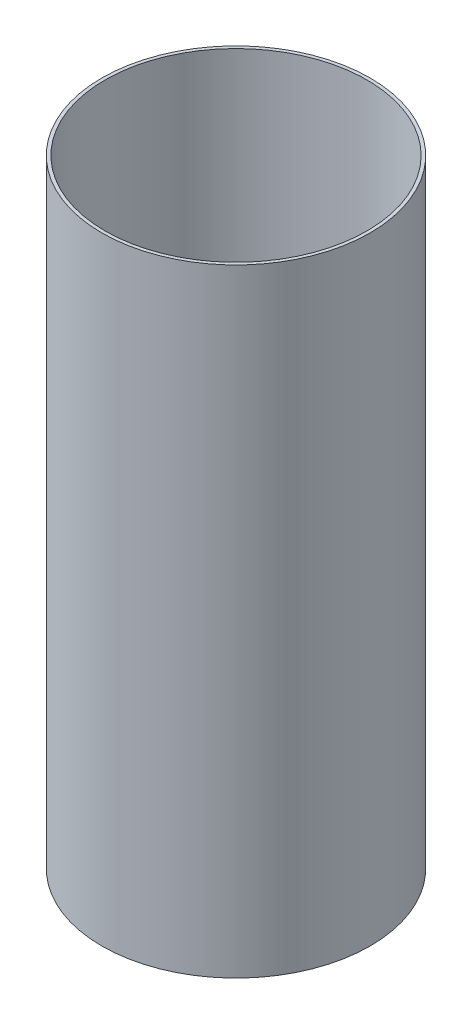
ISO-10303-21;
HEADER;
FILE_DESCRIPTION(('STEP AP214'),'2;1');
FILE_NAME('part.step','',(''),(''),'','','');
FILE_SCHEMA(('AUTOMOTIVE_DESIGN { 1 0 10303 214 1 1 1 1 }'));
ENDSEC;
DATA;
#1=APPLICATION_CONTEXT('core data for automotive mechanical design processes');
#2=APPLICATION_PROTOCOL_DEFINITION('international standard','automotive_design',2000,#1);
#3=PRODUCT_CONTEXT('',#1,'mechanical');
#4=PRODUCT('Part','Part','',(#3));
#5=PRODUCT_RELATED_PRODUCT_CATEGORY('part','',(#4));
#6=PRODUCT_DEFINITION_FORMATION('','',#4);
#7=PRODUCT_DEFINITION_CONTEXT('part definition',#1,'design');
#8=PRODUCT_DEFINITION('design','',#6,#7);
#9=PRODUCT_DEFINITION_SHAPE('','',#8);
#10=(LENGTH_UNIT() NAMED_UNIT(*) SI_UNIT(.MILLI.,.METRE.));
#11=(NAMED_UNIT(*) PLANE_ANGLE_UNIT() SI_UNIT($,.RADIAN.));
#12=(NAMED_UNIT(*) SI_UNIT($,.STERADIAN.) SOLID_ANGLE_UNIT());
#13=UNCERTAINTY_MEASURE_WITH_UNIT(LENGTH_MEASURE(1.E-05),#10,'distance_accuracy_value','');
#14=(GEOMETRIC_REPRESENTATION_CONTEXT(3) GLOBAL_UNCERTAINTY_ASSIGNED_CONTEXT((#13)) GLOBAL_UNIT_ASSIGNED_CONTEXT((#10,
#11,#12)) REPRESENTATION_CONTEXT('',''));
#15=CARTESIAN_POINT('',(0.,0.,0.));
#16=DIRECTION('',(0.,0.,1.));
#17=DIRECTION('',(1.,0.,0.));
#18=AXIS2_PLACEMENT_3D('',#15,#16,#17);
#19=CARTESIAN_POINT('',(0.,380.,0.));
#20=DIRECTION('',(0.,-1.,0.));
#21=DIRECTION('',(0.,0.,-1.));
#22=AXIS2_PLACEMENT_3D('',#19,#20,#21);
#23=CYLINDRICAL_SURFACE('',#22,76.55);
#24=CARTESIAN_POINT('',(0.,170.,0.));
#25=DIRECTION('',(0.,-1.,0.));
#26=DIRECTION('',(0.,0.,-1.));
#27=AXIS2_PLACEMENT_3D('',#24,#25,#26);
#28=CIRCLE('',#27,76.55);
#29=CARTESIAN_POINT('',(0.,170.,-76.55));
#30=VERTEX_POINT('',#29);
#31=EDGE_CURVE('E50',#30,#30,#28,.T.);
#32=ORIENTED_EDGE('',*,*,#31,.T.);
#33=EDGE_LOOP('',(#32));
#34=FACE_BOUND('',#33,.T.);
#35=CARTESIAN_POINT('',(0.,225.,0.));
#36=DIRECTION('',(0.,1.,0.));
#37=DIRECTION('',(0.,0.,1.));
#38=AXIS2_PLACEMENT_3D('',#35,#36,#37);
#39=CIRCLE('',#38,76.55);
#40=CARTESIAN_POINT('',(0.,225.,76.55));
#41=VERTEX_POINT('',#40);
#42=EDGE_CURVE('E41',#41,#41,#39,.T.);
#43=ORIENTED_EDGE('',*,*,#42,.T.);
#44=EDGE_LOOP('',(#43));
#45=FACE_BOUND('',#44,.T.);
#46=ADVANCED_FACE('F37',(#34,#45),#23,.F.);
#47=CARTESIAN_POINT('',(0.,380.,0.));
#48=DIRECTION('',(0.,1.,0.));
#49=DIRECTION('',(0.,0.,1.));
#50=AXIS2_PLACEMENT_3D('',#47,#48,#49);
#51=PLANE('',#50);
#52=CARTESIAN_POINT('',(0.,380.,0.));
#53=DIRECTION('',(0.,1.,0.));
#54=DIRECTION('',(0.,0.,1.));
#55=AXIS2_PLACEMENT_3D('',#52,#53,#54);
#56=CIRCLE('',#55,80.55);
#57=CARTESIAN_POINT('',(0.,380.,80.55));
#58=VERTEX_POINT('',#57);
#59=EDGE_CURVE('E64',#58,#58,#56,.T.);
#60=ORIENTED_EDGE('',*,*,#59,.F.);
#61=EDGE_LOOP('',(#60));
#62=FACE_BOUND('',#61,.T.);
#63=CARTESIAN_POINT('',(0.,380.,0.));
#64=DIRECTION('',(0.,1.,0.));
#65=DIRECTION('',(0.,0.,1.));
#66=AXIS2_PLACEMENT_3D('',#63,#64,#65);
#67=CIRCLE('',#66,82.55);
#68=CARTESIAN_POINT('',(0.,380.,82.55));
#69=VERTEX_POINT('',#68);
#70=EDGE_CURVE('E10',#69,#69,#67,.T.);
#71=ORIENTED_EDGE('',*,*,#70,.T.);
#72=EDGE_LOOP('',(#71));
#73=FACE_BOUND('',#72,.T.);
#74=ADVANCED_FACE('F86',(#62,#73),#51,.T.);
#75=CARTESIAN_POINT('',(0.,0.,0.));
#76=DIRECTION('',(0.,1.,0.));
#77=DIRECTION('',(0.,0.,1.));
#78=AXIS2_PLACEMENT_3D('',#75,#76,#77);
#79=PLANE('',#78);
#80=CARTESIAN_POINT('',(0.,0.,0.));
#81=DIRECTION('',(0.,-1.,0.));
#82=DIRECTION('',(0.,0.,-1.));
#83=AXIS2_PLACEMENT_3D('',#80,#81,#82);
#84=CIRCLE('',#83,80.55);
#85=CARTESIAN_POINT('',(0.,0.,-80.55));
#86=VERTEX_POINT('',#85);
#87=EDGE_CURVE('E53',#86,#86,#84,.T.);
#88=ORIENTED_EDGE('',*,*,#87,.F.);
#89=EDGE_LOOP('',(#88));
#90=FACE_BOUND('',#89,.T.);
#91=CARTESIAN_POINT('',(0.,0.,0.));
#92=DIRECTION('',(0.,1.,0.));
#93=DIRECTION('',(0.,0.,1.));
#94=AXIS2_PLACEMENT_3D('',#91,#92,#93);
#95=CIRCLE('',#94,82.55);
#96=CARTESIAN_POINT('',(0.,0.,82.55));
#97=VERTEX_POINT('',#96);
#98=EDGE_CURVE('E45',#97,#97,#95,.T.);
#99=ORIENTED_EDGE('',*,*,#98,.F.);
#100=EDGE_LOOP('',(#99));
#101=FACE_BOUND('',#100,.T.);
#102=ADVANCED_FACE('F91',(#90,#101),#79,.F.);
#103=CARTESIAN_POINT('',(0.,380.,0.));
#104=DIRECTION('',(0.,-1.,0.));
#105=DIRECTION('',(0.,0.,-1.));
#106=AXIS2_PLACEMENT_3D('',#103,#104,#105);
#107=CYLINDRICAL_SURFACE('',#106,82.55);
#108=ORIENTED_EDGE('',*,*,#70,.F.);
#109=EDGE_LOOP('',(#108));
#110=FACE_BOUND('',#109,.T.);
#111=ORIENTED_EDGE('',*,*,#98,.T.);
#112=EDGE_LOOP('',(#111));
#113=FACE_BOUND('',#112,.T.);
#114=ADVANCED_FACE('F39',(#110,#113),#107,.T.);
#115=CARTESIAN_POINT('',(0.,170.,0.));
#116=DIRECTION('',(0.,-1.,0.));
#117=DIRECTION('',(0.,0.,-1.));
#118=AXIS2_PLACEMENT_3D('',#115,#116,#117);
#119=CYLINDRICAL_SURFACE('',#118,80.55);
#120=CARTESIAN_POINT('',(0.,170.,0.));
#121=DIRECTION('',(0.,-1.,0.));
#122=DIRECTION('',(0.,0.,-1.));
#123=AXIS2_PLACEMENT_3D('',#120,#121,#122);
#124=CIRCLE('',#123,80.55);
#125=CARTESIAN_POINT('',(0.,170.,-80.55));
#126=VERTEX_POINT('',#125);
#127=EDGE_CURVE('E56',#126,#126,#124,.T.);
#128=ORIENTED_EDGE('',*,*,#127,.F.);
#129=EDGE_LOOP('',(#128));
#130=FACE_BOUND('',#129,.T.);
#131=ORIENTED_EDGE('',*,*,#87,.T.);
#132=EDGE_LOOP('',(#131));
#133=FACE_BOUND('',#132,.T.);
#134=ADVANCED_FACE('F95',(#130,#133),#119,.F.);
#135=CARTESIAN_POINT('',(0.,170.,0.));
#136=DIRECTION('',(0.,-1.,0.));
#137=DIRECTION('',(0.,0.,-1.));
#138=AXIS2_PLACEMENT_3D('',#135,#136,#137);
#139=PLANE('',#138);
#140=ORIENTED_EDGE('',*,*,#31,.F.);
#141=EDGE_LOOP('',(#140));
#142=FACE_BOUND('',#141,.T.);
#143=ORIENTED_EDGE('',*,*,#127,.T.);
#144=EDGE_LOOP('',(#143));
#145=FACE_BOUND('',#144,.T.);
#146=ADVANCED_FACE('F82',(#142,#145),#139,.T.);
#147=CARTESIAN_POINT('',(0.,225.,0.));
#148=DIRECTION('',(0.,1.,0.));
#149=DIRECTION('',(0.,0.,1.));
#150=AXIS2_PLACEMENT_3D('',#147,#148,#149);
#151=CYLINDRICAL_SURFACE('',#150,80.55);
#152=CARTESIAN_POINT('',(0.,225.,0.));
#153=DIRECTION('',(0.,1.,0.));
#154=DIRECTION('',(0.,0.,1.));
#155=AXIS2_PLACEMENT_3D('',#152,#153,#154);
#156=CIRCLE('',#155,80.55);
#157=CARTESIAN_POINT('',(0.,225.,80.55));
#158=VERTEX_POINT('',#157);
#159=EDGE_CURVE('E67',#158,#158,#156,.T.);
#160=ORIENTED_EDGE('',*,*,#159,.F.);
#161=EDGE_LOOP('',(#160));
#162=FACE_BOUND('',#161,.T.);
#163=ORIENTED_EDGE('',*,*,#59,.T.);
#164=EDGE_LOOP('',(#163));
#165=FACE_BOUND('',#164,.T.);
#166=ADVANCED_FACE('F77',(#162,#165),#151,.F.);
#167=CARTESIAN_POINT('',(0.,225.,0.));
#168=DIRECTION('',(0.,1.,0.));
#169=DIRECTION('',(0.,0.,1.));
#170=AXIS2_PLACEMENT_3D('',#167,#168,#169);
#171=PLANE('',#170);
#172=ORIENTED_EDGE('',*,*,#42,.F.);
#173=EDGE_LOOP('',(#172));
#174=FACE_BOUND('',#173,.T.);
#175=ORIENTED_EDGE('',*,*,#159,.T.);
#176=EDGE_LOOP('',(#175));
#177=FACE_BOUND('',#176,.T.);
#178=ADVANCED_FACE('F75',(#174,#177),#171,.T.);
#179=CLOSED_SHELL('',(#46,#74,#102,#114,#134,#146,#166,#178));
#180=MANIFOLD_SOLID_BREP('B2',#179);
#181=ADVANCED_BREP_SHAPE_REPRESENTATION('',(#18,#180),#14);
#182=SHAPE_DEFINITION_REPRESENTATION(#9,#181);
ENDSEC;
END-ISO-10303-21;
